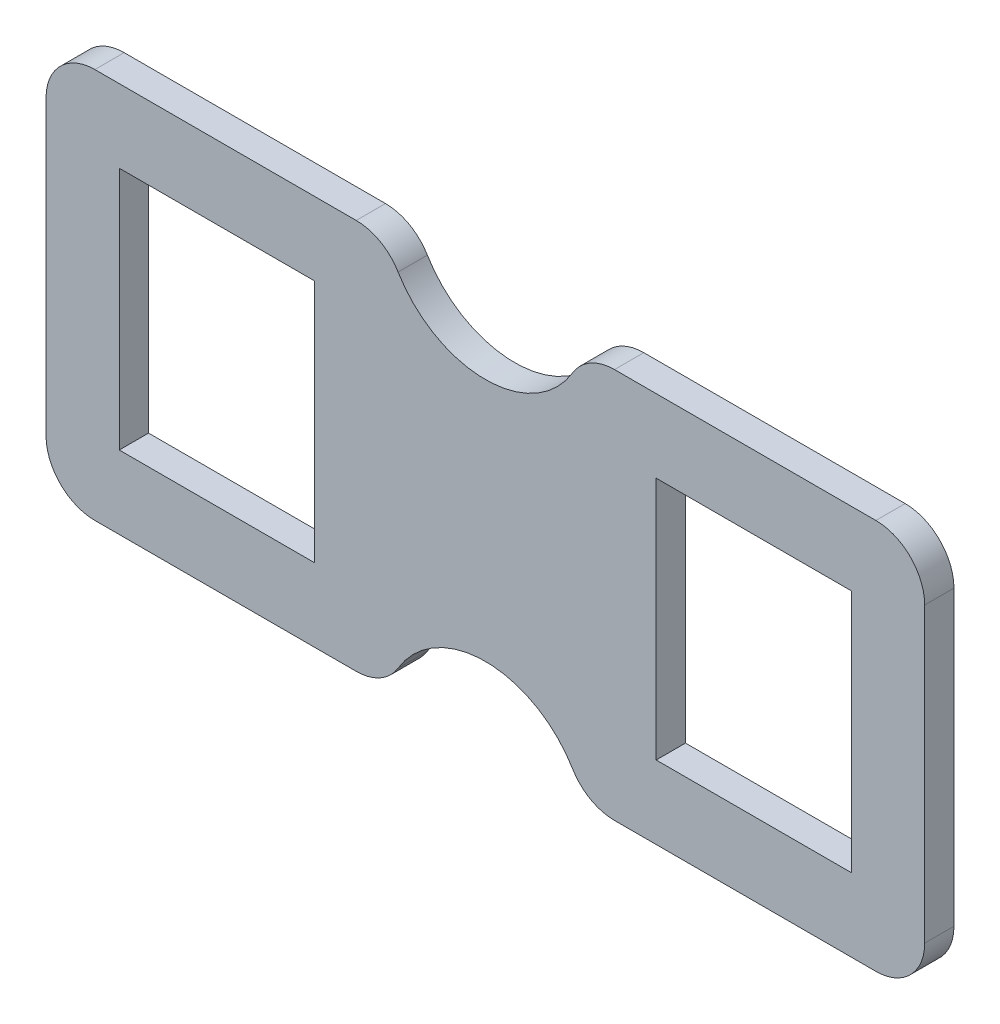
ISO-10303-21;
HEADER;
FILE_DESCRIPTION(('STEP AP214'),'2;1');
FILE_NAME('part.step','',(''),(''),'','','');
FILE_SCHEMA(('AUTOMOTIVE_DESIGN { 1 0 10303 214 1 1 1 1 }'));
ENDSEC;
DATA;
#1=APPLICATION_CONTEXT('core data for automotive mechanical design processes');
#2=APPLICATION_PROTOCOL_DEFINITION('international standard','automotive_design',2000,#1);
#3=PRODUCT_CONTEXT('',#1,'mechanical');
#4=PRODUCT('Part','Part','',(#3));
#5=PRODUCT_RELATED_PRODUCT_CATEGORY('part','',(#4));
#6=PRODUCT_DEFINITION_FORMATION('','',#4);
#7=PRODUCT_DEFINITION_CONTEXT('part definition',#1,'design');
#8=PRODUCT_DEFINITION('design','',#6,#7);
#9=PRODUCT_DEFINITION_SHAPE('','',#8);
#10=(LENGTH_UNIT() NAMED_UNIT(*) SI_UNIT(.MILLI.,.METRE.));
#11=(NAMED_UNIT(*) PLANE_ANGLE_UNIT() SI_UNIT($,.RADIAN.));
#12=(NAMED_UNIT(*) SI_UNIT($,.STERADIAN.) SOLID_ANGLE_UNIT());
#13=UNCERTAINTY_MEASURE_WITH_UNIT(LENGTH_MEASURE(1.E-05),#10,'distance_accuracy_value','');
#14=(GEOMETRIC_REPRESENTATION_CONTEXT(3) GLOBAL_UNCERTAINTY_ASSIGNED_CONTEXT((#13)) GLOBAL_UNIT_ASSIGNED_CONTEXT((#10,
#11,#12)) REPRESENTATION_CONTEXT('',''));
#15=CARTESIAN_POINT('',(0.,0.,0.));
#16=DIRECTION('',(0.,0.,1.));
#17=DIRECTION('',(1.,0.,0.));
#18=AXIS2_PLACEMENT_3D('',#15,#16,#17);
#19=CARTESIAN_POINT('',(-114.3,109.008333333333,7.62));
#20=DIRECTION('',(0.,0.,1.));
#21=DIRECTION('',(1.,0.,0.));
#22=AXIS2_PLACEMENT_3D('',#19,#20,#21);
#23=PLANE('',#22);
#24=DIRECTION('',(-1.,0.,0.));
#25=VECTOR('',#24,1.);
#26=CARTESIAN_POINT('',(-139.7,101.6,7.62));
#27=LINE('',#26,#25);
#28=CARTESIAN_POINT('',(-147.90104165052,101.6,7.62));
#29=VERTEX_POINT('',#28);
#30=CARTESIAN_POINT('',(-215.9,101.6,7.62));
#31=VERTEX_POINT('',#30);
#32=EDGE_CURVE('E313',#29,#31,#27,.T.);
#33=ORIENTED_EDGE('',*,*,#32,.T.);
#34=CARTESIAN_POINT('',(-215.9,88.8999999999999,7.62));
#35=DIRECTION('',(0.,0.,1.));
#36=DIRECTION('',(1.,0.,0.));
#37=AXIS2_PLACEMENT_3D('',#34,#35,#36);
#38=CIRCLE('',#37,12.7);
#39=CARTESIAN_POINT('',(-228.6,88.8999999999999,7.62));
#40=VERTEX_POINT('',#39);
#41=EDGE_CURVE('E418',#31,#40,#38,.T.);
#42=ORIENTED_EDGE('',*,*,#41,.T.);
#43=DIRECTION('',(0.,-1.,0.));
#44=VECTOR('',#43,1.);
#45=CARTESIAN_POINT('',(-228.6,0.,7.62));
#46=LINE('',#45,#44);
#47=CARTESIAN_POINT('',(-228.6,12.7,7.62));
#48=VERTEX_POINT('',#47);
#49=EDGE_CURVE('E317',#40,#48,#46,.T.);
#50=ORIENTED_EDGE('',*,*,#49,.T.);
#51=CARTESIAN_POINT('',(-215.9,12.7,7.62));
#52=DIRECTION('',(0.,0.,1.));
#53=DIRECTION('',(1.,0.,0.));
#54=AXIS2_PLACEMENT_3D('',#51,#52,#53);
#55=CIRCLE('',#54,12.7);
#56=CARTESIAN_POINT('',(-215.9,0.,7.62));
#57=VERTEX_POINT('',#56);
#58=EDGE_CURVE('E415',#48,#57,#55,.T.);
#59=ORIENTED_EDGE('',*,*,#58,.T.);
#60=DIRECTION('',(1.,0.,0.));
#61=VECTOR('',#60,1.);
#62=CARTESIAN_POINT('',(-139.7,0.,7.62));
#63=LINE('',#62,#61);
#64=CARTESIAN_POINT('',(-147.90104165052,0.,7.62));
#65=VERTEX_POINT('',#64);
#66=EDGE_CURVE('E321',#57,#65,#63,.T.);
#67=ORIENTED_EDGE('',*,*,#66,.T.);
#68=CARTESIAN_POINT('',(-147.90104165052,12.7,7.62));
#69=DIRECTION('',(0.,0.,1.));
#70=DIRECTION('',(1.,0.,0.));
#71=AXIS2_PLACEMENT_3D('',#68,#69,#70);
#72=CIRCLE('',#71,12.7);
#73=CARTESIAN_POINT('',(-137.003406520622,6.17837837837838,7.62));
#74=VERTEX_POINT('',#73);
#75=EDGE_CURVE('E412',#65,#74,#72,.T.);
#76=ORIENTED_EDGE('',*,*,#75,.T.);
#77=CARTESIAN_POINT('',(-114.3,-7.40833333333334,7.62));
#78=DIRECTION('',(0.,0.,-1.));
#79=DIRECTION('',(-1.,0.,0.));
#80=AXIS2_PLACEMENT_3D('',#77,#78,#79);
#81=CIRCLE('',#80,26.4583333333333);
#82=CARTESIAN_POINT('',(-91.5965934793782,6.17837837837837,7.62));
#83=VERTEX_POINT('',#82);
#84=EDGE_CURVE('E325',#74,#83,#81,.T.);
#85=ORIENTED_EDGE('',*,*,#84,.T.);
#86=CARTESIAN_POINT('',(-80.6989583494797,12.7,7.62));
#87=DIRECTION('',(0.,0.,1.));
#88=DIRECTION('',(1.,0.,0.));
#89=AXIS2_PLACEMENT_3D('',#86,#87,#88);
#90=CIRCLE('',#89,12.7);
#91=CARTESIAN_POINT('',(-80.6989583494797,0.,7.62));
#92=VERTEX_POINT('',#91);
#93=EDGE_CURVE('E62',#83,#92,#90,.T.);
#94=ORIENTED_EDGE('',*,*,#93,.T.);
#95=DIRECTION('',(1.,0.,0.));
#96=VECTOR('',#95,1.);
#97=CARTESIAN_POINT('',(0.,0.,7.62));
#98=LINE('',#97,#96);
#99=CARTESIAN_POINT('',(-12.7,0.,7.62));
#100=VERTEX_POINT('',#99);
#101=EDGE_CURVE('E328',#92,#100,#98,.T.);
#102=ORIENTED_EDGE('',*,*,#101,.T.);
#103=CARTESIAN_POINT('',(-12.7,12.7,7.62));
#104=DIRECTION('',(0.,0.,1.));
#105=DIRECTION('',(1.,0.,0.));
#106=AXIS2_PLACEMENT_3D('',#103,#104,#105);
#107=CIRCLE('',#106,12.7);
#108=CARTESIAN_POINT('',(0.,12.7,7.62));
#109=VERTEX_POINT('',#108);
#110=EDGE_CURVE('E407',#100,#109,#107,.T.);
#111=ORIENTED_EDGE('',*,*,#110,.T.);
#112=DIRECTION('',(0.,1.,0.));
#113=VECTOR('',#112,1.);
#114=CARTESIAN_POINT('',(0.,0.,7.62));
#115=LINE('',#114,#113);
#116=CARTESIAN_POINT('',(0.,88.9,7.62));
#117=VERTEX_POINT('',#116);
#118=EDGE_CURVE('E300',#109,#117,#115,.T.);
#119=ORIENTED_EDGE('',*,*,#118,.T.);
#120=CARTESIAN_POINT('',(-12.7,88.9,7.62));
#121=DIRECTION('',(0.,0.,1.));
#122=DIRECTION('',(1.,0.,0.));
#123=AXIS2_PLACEMENT_3D('',#120,#121,#122);
#124=CIRCLE('',#123,12.7);
#125=CARTESIAN_POINT('',(-12.7,101.6,7.62));
#126=VERTEX_POINT('',#125);
#127=EDGE_CURVE('E404',#117,#126,#124,.T.);
#128=ORIENTED_EDGE('',*,*,#127,.T.);
#129=DIRECTION('',(-1.,0.,0.));
#130=VECTOR('',#129,1.);
#131=CARTESIAN_POINT('',(0.,101.6,7.62));
#132=LINE('',#131,#130);
#133=CARTESIAN_POINT('',(-80.6989583494797,101.6,7.62));
#134=VERTEX_POINT('',#133);
#135=EDGE_CURVE('E304',#126,#134,#132,.T.);
#136=ORIENTED_EDGE('',*,*,#135,.T.);
#137=CARTESIAN_POINT('',(-80.6989583494797,88.9,7.62));
#138=DIRECTION('',(0.,0.,1.));
#139=DIRECTION('',(1.,0.,0.));
#140=AXIS2_PLACEMENT_3D('',#137,#138,#139);
#141=CIRCLE('',#140,12.7);
#142=CARTESIAN_POINT('',(-91.5965934793782,95.4216216216216,7.62));
#143=VERTEX_POINT('',#142);
#144=EDGE_CURVE('E401',#134,#143,#141,.T.);
#145=ORIENTED_EDGE('',*,*,#144,.T.);
#146=CARTESIAN_POINT('',(-114.3,109.008333333333,7.62));
#147=DIRECTION('',(0.,0.,-1.));
#148=DIRECTION('',(1.,0.,0.));
#149=AXIS2_PLACEMENT_3D('',#146,#147,#148);
#150=CIRCLE('',#149,26.4583333333333);
#151=CARTESIAN_POINT('',(-137.003406520622,95.4216216216216,7.62));
#152=VERTEX_POINT('',#151);
#153=EDGE_CURVE('E309',#143,#152,#150,.T.);
#154=ORIENTED_EDGE('',*,*,#153,.T.);
#155=CARTESIAN_POINT('',(-147.90104165052,88.8999999999999,7.62));
#156=DIRECTION('',(0.,0.,1.));
#157=DIRECTION('',(1.,0.,0.));
#158=AXIS2_PLACEMENT_3D('',#155,#156,#157);
#159=CIRCLE('',#158,12.7);
#160=EDGE_CURVE('E398',#152,#29,#159,.T.);
#161=ORIENTED_EDGE('',*,*,#160,.T.);
#162=EDGE_LOOP('',(#33,#42,#50,#59,#67,#76,#85,#94,#102,#111,#119,#128,#136,#145,#154,#161));
#163=FACE_BOUND('',#162,.T.);
#164=DIRECTION('',(1.,0.,0.));
#165=VECTOR('',#164,1.);
#166=CARTESIAN_POINT('',(-209.55,19.05,7.62));
#167=LINE('',#166,#165);
#168=CARTESIAN_POINT('',(-209.55,19.05,7.62));
#169=VERTEX_POINT('',#168);
#170=CARTESIAN_POINT('',(-158.75,19.05,7.62));
#171=VERTEX_POINT('',#170);
#172=EDGE_CURVE('E260',#169,#171,#167,.T.);
#173=ORIENTED_EDGE('',*,*,#172,.F.);
#174=DIRECTION('',(0.,-1.,0.));
#175=VECTOR('',#174,1.);
#176=CARTESIAN_POINT('',(-209.55,82.5499999999999,7.62));
#177=LINE('',#176,#175);
#178=CARTESIAN_POINT('',(-209.55,82.5499999999999,7.62));
#179=VERTEX_POINT('',#178);
#180=EDGE_CURVE('E257',#179,#169,#177,.T.);
#181=ORIENTED_EDGE('',*,*,#180,.F.);
#182=DIRECTION('',(-1.,0.,0.));
#183=VECTOR('',#182,1.);
#184=CARTESIAN_POINT('',(-209.55,82.5499999999999,7.62));
#185=LINE('',#184,#183);
#186=CARTESIAN_POINT('',(-158.75,82.5499999999999,7.62));
#187=VERTEX_POINT('',#186);
#188=EDGE_CURVE('E268',#187,#179,#185,.T.);
#189=ORIENTED_EDGE('',*,*,#188,.F.);
#190=DIRECTION('',(0.,1.,0.));
#191=VECTOR('',#190,1.);
#192=CARTESIAN_POINT('',(-158.75,82.5499999999999,7.62));
#193=LINE('',#192,#191);
#194=EDGE_CURVE('E264',#171,#187,#193,.T.);
#195=ORIENTED_EDGE('',*,*,#194,.F.);
#196=EDGE_LOOP('',(#173,#181,#189,#195));
#197=FACE_BOUND('',#196,.T.);
#198=DIRECTION('',(1.,0.,0.));
#199=VECTOR('',#198,1.);
#200=CARTESIAN_POINT('',(-69.85,19.05,7.62));
#201=LINE('',#200,#199);
#202=CARTESIAN_POINT('',(-69.85,19.05,7.62));
#203=VERTEX_POINT('',#202);
#204=CARTESIAN_POINT('',(-19.05,19.05,7.62));
#205=VERTEX_POINT('',#204);
#206=EDGE_CURVE('E215',#203,#205,#201,.T.);
#207=ORIENTED_EDGE('',*,*,#206,.F.);
#208=DIRECTION('',(0.,-1.,0.));
#209=VECTOR('',#208,1.);
#210=CARTESIAN_POINT('',(-69.85,19.05,7.62));
#211=LINE('',#210,#209);
#212=CARTESIAN_POINT('',(-69.85,82.5499999999999,7.62));
#213=VERTEX_POINT('',#212);
#214=EDGE_CURVE('E204',#213,#203,#211,.T.);
#215=ORIENTED_EDGE('',*,*,#214,.F.);
#216=DIRECTION('',(-1.,0.,0.));
#217=VECTOR('',#216,1.);
#218=CARTESIAN_POINT('',(-69.85,82.5499999999999,7.62));
#219=LINE('',#218,#217);
#220=CARTESIAN_POINT('',(-19.05,82.5499999999999,7.62));
#221=VERTEX_POINT('',#220);
#222=EDGE_CURVE('E233',#221,#213,#219,.T.);
#223=ORIENTED_EDGE('',*,*,#222,.F.);
#224=DIRECTION('',(0.,1.,0.));
#225=VECTOR('',#224,1.);
#226=CARTESIAN_POINT('',(-19.05,19.05,7.62));
#227=LINE('',#226,#225);
#228=EDGE_CURVE('E229',#205,#221,#227,.T.);
#229=ORIENTED_EDGE('',*,*,#228,.F.);
#230=EDGE_LOOP('',(#207,#215,#223,#229));
#231=FACE_BOUND('',#230,.T.);
#232=ADVANCED_FACE('F39',(#163,#197,#231),#23,.T.);
#233=CARTESIAN_POINT('',(-114.3,109.008333333333,0.));
#234=DIRECTION('',(0.,0.,1.));
#235=DIRECTION('',(1.,0.,0.));
#236=AXIS2_PLACEMENT_3D('',#233,#234,#235);
#237=PLANE('',#236);
#238=DIRECTION('',(0.,-1.,0.));
#239=VECTOR('',#238,1.);
#240=CARTESIAN_POINT('',(-209.55,82.5499999999999,0.));
#241=LINE('',#240,#239);
#242=CARTESIAN_POINT('',(-209.55,82.5499999999999,0.));
#243=VERTEX_POINT('',#242);
#244=CARTESIAN_POINT('',(-209.55,19.05,0.));
#245=VERTEX_POINT('',#244);
#246=EDGE_CURVE('E224',#243,#245,#241,.T.);
#247=ORIENTED_EDGE('',*,*,#246,.T.);
#248=DIRECTION('',(1.,0.,0.));
#249=VECTOR('',#248,1.);
#250=CARTESIAN_POINT('',(-209.55,19.05,0.));
#251=LINE('',#250,#249);
#252=CARTESIAN_POINT('',(-158.75,19.05,0.));
#253=VERTEX_POINT('',#252);
#254=EDGE_CURVE('E275',#245,#253,#251,.T.);
#255=ORIENTED_EDGE('',*,*,#254,.T.);
#256=DIRECTION('',(0.,1.,0.));
#257=VECTOR('',#256,1.);
#258=CARTESIAN_POINT('',(-158.75,82.5499999999999,0.));
#259=LINE('',#258,#257);
#260=CARTESIAN_POINT('',(-158.75,82.5499999999999,0.));
#261=VERTEX_POINT('',#260);
#262=EDGE_CURVE('E279',#253,#261,#259,.T.);
#263=ORIENTED_EDGE('',*,*,#262,.T.);
#264=DIRECTION('',(-1.,0.,0.));
#265=VECTOR('',#264,1.);
#266=CARTESIAN_POINT('',(-209.55,82.5499999999999,0.));
#267=LINE('',#266,#265);
#268=EDGE_CURVE('E261',#261,#243,#267,.T.);
#269=ORIENTED_EDGE('',*,*,#268,.T.);
#270=EDGE_LOOP('',(#247,#255,#263,#269));
#271=FACE_BOUND('',#270,.T.);
#272=DIRECTION('',(0.,-1.,0.));
#273=VECTOR('',#272,1.);
#274=CARTESIAN_POINT('',(-228.6,0.,0.));
#275=LINE('',#274,#273);
#276=CARTESIAN_POINT('',(-228.6,88.8999999999999,0.));
#277=VERTEX_POINT('',#276);
#278=CARTESIAN_POINT('',(-228.6,12.7,0.));
#279=VERTEX_POINT('',#278);
#280=EDGE_CURVE('E347',#277,#279,#275,.T.);
#281=ORIENTED_EDGE('',*,*,#280,.F.);
#282=CARTESIAN_POINT('',(-215.9,88.8999999999999,0.));
#283=DIRECTION('',(0.,0.,1.));
#284=DIRECTION('',(1.,0.,0.));
#285=AXIS2_PLACEMENT_3D('',#282,#283,#284);
#286=CIRCLE('',#285,12.7);
#287=CARTESIAN_POINT('',(-215.9,101.6,0.));
#288=VERTEX_POINT('',#287);
#289=EDGE_CURVE('E388',#277,#288,#286,.F.);
#290=ORIENTED_EDGE('',*,*,#289,.T.);
#291=DIRECTION('',(-1.,0.,0.));
#292=VECTOR('',#291,1.);
#293=CARTESIAN_POINT('',(-139.7,101.6,0.));
#294=LINE('',#293,#292);
#295=CARTESIAN_POINT('',(-147.90104165052,101.6,0.));
#296=VERTEX_POINT('',#295);
#297=EDGE_CURVE('E343',#296,#288,#294,.T.);
#298=ORIENTED_EDGE('',*,*,#297,.F.);
#299=CARTESIAN_POINT('',(-147.90104165052,88.8999999999999,0.));
#300=DIRECTION('',(0.,0.,1.));
#301=DIRECTION('',(1.,0.,0.));
#302=AXIS2_PLACEMENT_3D('',#299,#300,#301);
#303=CIRCLE('',#302,12.7);
#304=CARTESIAN_POINT('',(-137.003406520622,95.4216216216216,0.));
#305=VERTEX_POINT('',#304);
#306=EDGE_CURVE('E367',#296,#305,#303,.F.);
#307=ORIENTED_EDGE('',*,*,#306,.T.);
#308=CARTESIAN_POINT('',(-114.3,109.008333333333,0.));
#309=DIRECTION('',(0.,0.,-1.));
#310=DIRECTION('',(1.,0.,0.));
#311=AXIS2_PLACEMENT_3D('',#308,#309,#310);
#312=CIRCLE('',#311,26.4583333333333);
#313=CARTESIAN_POINT('',(-91.5965934793782,95.4216216216216,0.));
#314=VERTEX_POINT('',#313);
#315=EDGE_CURVE('E339',#314,#305,#312,.T.);
#316=ORIENTED_EDGE('',*,*,#315,.F.);
#317=CARTESIAN_POINT('',(-80.6989583494797,88.9,0.));
#318=DIRECTION('',(0.,0.,1.));
#319=DIRECTION('',(1.,0.,0.));
#320=AXIS2_PLACEMENT_3D('',#317,#318,#319);
#321=CIRCLE('',#320,12.7);
#322=CARTESIAN_POINT('',(-80.6989583494797,101.6,0.));
#323=VERTEX_POINT('',#322);
#324=EDGE_CURVE('E370',#314,#323,#321,.F.);
#325=ORIENTED_EDGE('',*,*,#324,.T.);
#326=DIRECTION('',(-1.,0.,0.));
#327=VECTOR('',#326,1.);
#328=CARTESIAN_POINT('',(0.,101.6,0.));
#329=LINE('',#328,#327);
#330=CARTESIAN_POINT('',(-12.7,101.6,0.));
#331=VERTEX_POINT('',#330);
#332=EDGE_CURVE('E335',#331,#323,#329,.T.);
#333=ORIENTED_EDGE('',*,*,#332,.F.);
#334=CARTESIAN_POINT('',(-12.7,88.9,0.));
#335=DIRECTION('',(0.,0.,1.));
#336=DIRECTION('',(1.,0.,0.));
#337=AXIS2_PLACEMENT_3D('',#334,#335,#336);
#338=CIRCLE('',#337,12.7);
#339=CARTESIAN_POINT('',(0.,88.9,0.));
#340=VERTEX_POINT('',#339);
#341=EDGE_CURVE('E373',#331,#340,#338,.F.);
#342=ORIENTED_EDGE('',*,*,#341,.T.);
#343=DIRECTION('',(0.,1.,0.));
#344=VECTOR('',#343,1.);
#345=CARTESIAN_POINT('',(0.,0.,0.));
#346=LINE('',#345,#344);
#347=CARTESIAN_POINT('',(0.,12.7,0.));
#348=VERTEX_POINT('',#347);
#349=EDGE_CURVE('E299',#348,#340,#346,.T.);
#350=ORIENTED_EDGE('',*,*,#349,.F.);
#351=CARTESIAN_POINT('',(-12.7,12.7,0.));
#352=DIRECTION('',(0.,0.,1.));
#353=DIRECTION('',(1.,0.,0.));
#354=AXIS2_PLACEMENT_3D('',#351,#352,#353);
#355=CIRCLE('',#354,12.7);
#356=CARTESIAN_POINT('',(-12.7,0.,0.));
#357=VERTEX_POINT('',#356);
#358=EDGE_CURVE('E376',#348,#357,#355,.F.);
#359=ORIENTED_EDGE('',*,*,#358,.T.);
#360=DIRECTION('',(1.,0.,0.));
#361=VECTOR('',#360,1.);
#362=CARTESIAN_POINT('',(0.,0.,0.));
#363=LINE('',#362,#361);
#364=CARTESIAN_POINT('',(-80.6989583494797,0.,0.));
#365=VERTEX_POINT('',#364);
#366=EDGE_CURVE('E305',#365,#357,#363,.T.);
#367=ORIENTED_EDGE('',*,*,#366,.F.);
#368=CARTESIAN_POINT('',(-80.6989583494797,12.7,0.));
#369=DIRECTION('',(0.,0.,1.));
#370=DIRECTION('',(1.,0.,0.));
#371=AXIS2_PLACEMENT_3D('',#368,#369,#370);
#372=CIRCLE('',#371,12.7);
#373=CARTESIAN_POINT('',(-91.5965934793782,6.17837837837837,0.));
#374=VERTEX_POINT('',#373);
#375=EDGE_CURVE('E379',#365,#374,#372,.F.);
#376=ORIENTED_EDGE('',*,*,#375,.T.);
#377=CARTESIAN_POINT('',(-114.3,-7.40833333333334,0.));
#378=DIRECTION('',(0.,0.,-1.));
#379=DIRECTION('',(-1.,0.,0.));
#380=AXIS2_PLACEMENT_3D('',#377,#378,#379);
#381=CIRCLE('',#380,26.4583333333333);
#382=CARTESIAN_POINT('',(-137.003406520622,6.17837837837838,0.));
#383=VERTEX_POINT('',#382);
#384=EDGE_CURVE('E355',#383,#374,#381,.T.);
#385=ORIENTED_EDGE('',*,*,#384,.F.);
#386=CARTESIAN_POINT('',(-147.90104165052,12.7,0.));
#387=DIRECTION('',(0.,0.,1.));
#388=DIRECTION('',(1.,0.,0.));
#389=AXIS2_PLACEMENT_3D('',#386,#387,#388);
#390=CIRCLE('',#389,12.7);
#391=CARTESIAN_POINT('',(-147.90104165052,0.,0.));
#392=VERTEX_POINT('',#391);
#393=EDGE_CURVE('E382',#383,#392,#390,.F.);
#394=ORIENTED_EDGE('',*,*,#393,.T.);
#395=DIRECTION('',(1.,0.,0.));
#396=VECTOR('',#395,1.);
#397=CARTESIAN_POINT('',(-139.7,0.,0.));
#398=LINE('',#397,#396);
#399=CARTESIAN_POINT('',(-215.9,0.,0.));
#400=VERTEX_POINT('',#399);
#401=EDGE_CURVE('E351',#400,#392,#398,.T.);
#402=ORIENTED_EDGE('',*,*,#401,.F.);
#403=CARTESIAN_POINT('',(-215.9,12.7,0.));
#404=DIRECTION('',(0.,0.,1.));
#405=DIRECTION('',(1.,0.,0.));
#406=AXIS2_PLACEMENT_3D('',#403,#404,#405);
#407=CIRCLE('',#406,12.7);
#408=EDGE_CURVE('E385',#400,#279,#407,.F.);
#409=ORIENTED_EDGE('',*,*,#408,.T.);
#410=EDGE_LOOP('',(#281,#290,#298,#307,#316,#325,#333,#342,#350,#359,#367,#376,#385,#394,#402,#409));
#411=FACE_BOUND('',#410,.T.);
#412=DIRECTION('',(0.,-1.,0.));
#413=VECTOR('',#412,1.);
#414=CARTESIAN_POINT('',(-69.85,19.05,0.));
#415=LINE('',#414,#413);
#416=CARTESIAN_POINT('',(-69.85,82.5499999999999,0.));
#417=VERTEX_POINT('',#416);
#418=CARTESIAN_POINT('',(-69.85,19.05,0.));
#419=VERTEX_POINT('',#418);
#420=EDGE_CURVE('E238',#417,#419,#415,.T.);
#421=ORIENTED_EDGE('',*,*,#420,.T.);
#422=DIRECTION('',(1.,0.,0.));
#423=VECTOR('',#422,1.);
#424=CARTESIAN_POINT('',(-69.85,19.05,0.));
#425=LINE('',#424,#423);
#426=CARTESIAN_POINT('',(-19.05,19.05,0.));
#427=VERTEX_POINT('',#426);
#428=EDGE_CURVE('E222',#419,#427,#425,.T.);
#429=ORIENTED_EDGE('',*,*,#428,.T.);
#430=DIRECTION('',(0.,1.,0.));
#431=VECTOR('',#430,1.);
#432=CARTESIAN_POINT('',(-19.05,19.05,0.));
#433=LINE('',#432,#431);
#434=CARTESIAN_POINT('',(-19.05,82.5499999999999,0.));
#435=VERTEX_POINT('',#434);
#436=EDGE_CURVE('E243',#427,#435,#433,.T.);
#437=ORIENTED_EDGE('',*,*,#436,.T.);
#438=DIRECTION('',(-1.,0.,0.));
#439=VECTOR('',#438,1.);
#440=CARTESIAN_POINT('',(-69.85,82.5499999999999,0.));
#441=LINE('',#440,#439);
#442=EDGE_CURVE('E216',#435,#417,#441,.T.);
#443=ORIENTED_EDGE('',*,*,#442,.T.);
#444=EDGE_LOOP('',(#421,#429,#437,#443));
#445=FACE_BOUND('',#444,.T.);
#446=ADVANCED_FACE('F473',(#271,#411,#445),#237,.F.);
#447=CARTESIAN_POINT('',(0.,0.,7.62));
#448=DIRECTION('',(-1.,0.,0.));
#449=DIRECTION('',(0.,0.,1.));
#450=AXIS2_PLACEMENT_3D('',#447,#448,#449);
#451=PLANE('',#450);
#452=ORIENTED_EDGE('',*,*,#118,.F.);
#453=DIRECTION('',(0.,0.,-1.));
#454=VECTOR('',#453,1.);
#455=CARTESIAN_POINT('',(0.,12.7,7.62));
#456=LINE('',#455,#454);
#457=EDGE_CURVE('E444',#109,#348,#456,.T.);
#458=ORIENTED_EDGE('',*,*,#457,.T.);
#459=ORIENTED_EDGE('',*,*,#349,.T.);
#460=DIRECTION('',(0.,0.,-1.));
#461=VECTOR('',#460,1.);
#462=CARTESIAN_POINT('',(0.,88.9,7.62));
#463=LINE('',#462,#461);
#464=EDGE_CURVE('E441',#340,#117,#463,.F.);
#465=ORIENTED_EDGE('',*,*,#464,.T.);
#466=EDGE_LOOP('',(#452,#458,#459,#465));
#467=FACE_BOUND('',#466,.T.);
#468=ADVANCED_FACE('F513',(#467),#451,.F.);
#469=CARTESIAN_POINT('',(0.,101.6,7.62));
#470=DIRECTION('',(0.,-1.,0.));
#471=DIRECTION('',(1.,0.,0.));
#472=AXIS2_PLACEMENT_3D('',#469,#470,#471);
#473=PLANE('',#472);
#474=ORIENTED_EDGE('',*,*,#135,.F.);
#475=DIRECTION('',(0.,0.,-1.));
#476=VECTOR('',#475,1.);
#477=CARTESIAN_POINT('',(-12.7,101.6,7.62));
#478=LINE('',#477,#476);
#479=EDGE_CURVE('E451',#126,#331,#478,.T.);
#480=ORIENTED_EDGE('',*,*,#479,.T.);
#481=ORIENTED_EDGE('',*,*,#332,.T.);
#482=DIRECTION('',(0.,0.,-1.));
#483=VECTOR('',#482,1.);
#484=CARTESIAN_POINT('',(-80.6989583494797,101.6,7.62));
#485=LINE('',#484,#483);
#486=EDGE_CURVE('E448',#323,#134,#485,.F.);
#487=ORIENTED_EDGE('',*,*,#486,.T.);
#488=EDGE_LOOP('',(#474,#480,#481,#487));
#489=FACE_BOUND('',#488,.T.);
#490=ADVANCED_FACE('F522',(#489),#473,.F.);
#491=CARTESIAN_POINT('',(-114.3,109.008333333333,7.62));
#492=DIRECTION('',(0.,0.,-1.));
#493=DIRECTION('',(-1.,0.,0.));
#494=AXIS2_PLACEMENT_3D('',#491,#492,#493);
#495=CYLINDRICAL_SURFACE('',#494,26.4583333333333);
#496=ORIENTED_EDGE('',*,*,#153,.F.);
#497=DIRECTION('',(0.,0.,-1.));
#498=VECTOR('',#497,1.);
#499=CARTESIAN_POINT('',(-91.5965934793782,95.4216216216216,7.62));
#500=LINE('',#499,#498);
#501=EDGE_CURVE('E11',#143,#314,#500,.T.);
#502=ORIENTED_EDGE('',*,*,#501,.T.);
#503=ORIENTED_EDGE('',*,*,#315,.T.);
#504=DIRECTION('',(0.,0.,-1.));
#505=VECTOR('',#504,1.);
#506=CARTESIAN_POINT('',(-137.003406520622,95.4216216216216,7.62));
#507=LINE('',#506,#505);
#508=EDGE_CURVE('E48',#305,#152,#507,.F.);
#509=ORIENTED_EDGE('',*,*,#508,.T.);
#510=EDGE_LOOP('',(#496,#502,#503,#509));
#511=FACE_BOUND('',#510,.T.);
#512=ADVANCED_FACE('F458',(#511),#495,.F.);
#513=CARTESIAN_POINT('',(-139.7,101.6,7.62));
#514=DIRECTION('',(0.,-1.,0.));
#515=DIRECTION('',(0.,0.,-1.));
#516=AXIS2_PLACEMENT_3D('',#513,#514,#515);
#517=PLANE('',#516);
#518=ORIENTED_EDGE('',*,*,#297,.T.);
#519=DIRECTION('',(0.,0.,-1.));
#520=VECTOR('',#519,1.);
#521=CARTESIAN_POINT('',(-215.9,101.6,7.62));
#522=LINE('',#521,#520);
#523=EDGE_CURVE('E395',#288,#31,#522,.F.);
#524=ORIENTED_EDGE('',*,*,#523,.T.);
#525=ORIENTED_EDGE('',*,*,#32,.F.);
#526=DIRECTION('',(0.,0.,-1.));
#527=VECTOR('',#526,1.);
#528=CARTESIAN_POINT('',(-147.90104165052,101.6,7.62));
#529=LINE('',#528,#527);
#530=EDGE_CURVE('E391',#29,#296,#529,.T.);
#531=ORIENTED_EDGE('',*,*,#530,.T.);
#532=EDGE_LOOP('',(#518,#524,#525,#531));
#533=FACE_BOUND('',#532,.T.);
#534=ADVANCED_FACE('F469',(#533),#517,.F.);
#535=CARTESIAN_POINT('',(-228.6,0.,7.62));
#536=DIRECTION('',(1.,0.,0.));
#537=DIRECTION('',(0.,1.,0.));
#538=AXIS2_PLACEMENT_3D('',#535,#536,#537);
#539=PLANE('',#538);
#540=ORIENTED_EDGE('',*,*,#49,.F.);
#541=DIRECTION('',(0.,0.,-1.));
#542=VECTOR('',#541,1.);
#543=CARTESIAN_POINT('',(-228.6,88.8999999999999,7.62));
#544=LINE('',#543,#542);
#545=EDGE_CURVE('E363',#40,#277,#544,.T.);
#546=ORIENTED_EDGE('',*,*,#545,.T.);
#547=ORIENTED_EDGE('',*,*,#280,.T.);
#548=DIRECTION('',(0.,0.,-1.));
#549=VECTOR('',#548,1.);
#550=CARTESIAN_POINT('',(-228.6,12.7,7.62));
#551=LINE('',#550,#549);
#552=EDGE_CURVE('E331',#279,#48,#551,.F.);
#553=ORIENTED_EDGE('',*,*,#552,.T.);
#554=EDGE_LOOP('',(#540,#546,#547,#553));
#555=FACE_BOUND('',#554,.T.);
#556=ADVANCED_FACE('F481',(#555),#539,.F.);
#557=CARTESIAN_POINT('',(-139.7,0.,7.62));
#558=DIRECTION('',(0.,1.,0.));
#559=DIRECTION('',(-1.,0.,0.));
#560=AXIS2_PLACEMENT_3D('',#557,#558,#559);
#561=PLANE('',#560);
#562=ORIENTED_EDGE('',*,*,#66,.F.);
#563=DIRECTION('',(0.,0.,-1.));
#564=VECTOR('',#563,1.);
#565=CARTESIAN_POINT('',(-215.9,0.,7.62));
#566=LINE('',#565,#564);
#567=EDGE_CURVE('E424',#57,#400,#566,.T.);
#568=ORIENTED_EDGE('',*,*,#567,.T.);
#569=ORIENTED_EDGE('',*,*,#401,.T.);
#570=DIRECTION('',(0.,0.,-1.));
#571=VECTOR('',#570,1.);
#572=CARTESIAN_POINT('',(-147.90104165052,0.,7.62));
#573=LINE('',#572,#571);
#574=EDGE_CURVE('E421',#392,#65,#573,.F.);
#575=ORIENTED_EDGE('',*,*,#574,.T.);
#576=EDGE_LOOP('',(#562,#568,#569,#575));
#577=FACE_BOUND('',#576,.T.);
#578=ADVANCED_FACE('F490',(#577),#561,.F.);
#579=CARTESIAN_POINT('',(-114.3,-7.40833333333334,7.62));
#580=DIRECTION('',(0.,0.,-1.));
#581=DIRECTION('',(-1.,0.,0.));
#582=AXIS2_PLACEMENT_3D('',#579,#580,#581);
#583=CYLINDRICAL_SURFACE('',#582,26.4583333333333);
#584=ORIENTED_EDGE('',*,*,#84,.F.);
#585=DIRECTION('',(0.,0.,-1.));
#586=VECTOR('',#585,1.);
#587=CARTESIAN_POINT('',(-137.003406520622,6.17837837837837,7.62));
#588=LINE('',#587,#586);
#589=EDGE_CURVE('E431',#74,#383,#588,.T.);
#590=ORIENTED_EDGE('',*,*,#589,.T.);
#591=ORIENTED_EDGE('',*,*,#384,.T.);
#592=DIRECTION('',(0.,0.,-1.));
#593=VECTOR('',#592,1.);
#594=CARTESIAN_POINT('',(-91.5965934793782,6.17837837837836,7.62));
#595=LINE('',#594,#593);
#596=EDGE_CURVE('E428',#374,#83,#595,.F.);
#597=ORIENTED_EDGE('',*,*,#596,.T.);
#598=EDGE_LOOP('',(#584,#590,#591,#597));
#599=FACE_BOUND('',#598,.T.);
#600=ADVANCED_FACE('F499',(#599),#583,.F.);
#601=CARTESIAN_POINT('',(0.,0.,7.62));
#602=DIRECTION('',(0.,1.,0.));
#603=DIRECTION('',(-1.,0.,0.));
#604=AXIS2_PLACEMENT_3D('',#601,#602,#603);
#605=PLANE('',#604);
#606=ORIENTED_EDGE('',*,*,#101,.F.);
#607=DIRECTION('',(0.,0.,-1.));
#608=VECTOR('',#607,1.);
#609=CARTESIAN_POINT('',(-80.6989583494797,0.,7.62));
#610=LINE('',#609,#608);
#611=EDGE_CURVE('E437',#92,#365,#610,.T.);
#612=ORIENTED_EDGE('',*,*,#611,.T.);
#613=ORIENTED_EDGE('',*,*,#366,.T.);
#614=DIRECTION('',(0.,0.,-1.));
#615=VECTOR('',#614,1.);
#616=CARTESIAN_POINT('',(-12.7,0.,7.62));
#617=LINE('',#616,#615);
#618=EDGE_CURVE('E55',#357,#100,#617,.F.);
#619=ORIENTED_EDGE('',*,*,#618,.T.);
#620=EDGE_LOOP('',(#606,#612,#613,#619));
#621=FACE_BOUND('',#620,.T.);
#622=ADVANCED_FACE('F505',(#621),#605,.F.);
#623=CARTESIAN_POINT('',(-209.55,82.5499999999999,7.62));
#624=DIRECTION('',(1.,0.,0.));
#625=DIRECTION('',(0.,0.,-1.));
#626=AXIS2_PLACEMENT_3D('',#623,#624,#625);
#627=PLANE('',#626);
#628=ORIENTED_EDGE('',*,*,#246,.F.);
#629=DIRECTION('',(0.,0.,-1.));
#630=VECTOR('',#629,1.);
#631=CARTESIAN_POINT('',(-209.55,82.5499999999999,7.62));
#632=LINE('',#631,#630);
#633=EDGE_CURVE('E271',#179,#243,#632,.T.);
#634=ORIENTED_EDGE('',*,*,#633,.F.);
#635=ORIENTED_EDGE('',*,*,#180,.T.);
#636=DIRECTION('',(0.,0.,-1.));
#637=VECTOR('',#636,1.);
#638=CARTESIAN_POINT('',(-209.55,19.05,7.62));
#639=LINE('',#638,#637);
#640=EDGE_CURVE('E295',#169,#245,#639,.T.);
#641=ORIENTED_EDGE('',*,*,#640,.T.);
#642=EDGE_LOOP('',(#628,#634,#635,#641));
#643=FACE_BOUND('',#642,.T.);
#644=ADVANCED_FACE('F540',(#643),#627,.T.);
#645=CARTESIAN_POINT('',(-209.55,19.05,7.62));
#646=DIRECTION('',(0.,1.,0.));
#647=DIRECTION('',(0.,0.,1.));
#648=AXIS2_PLACEMENT_3D('',#645,#646,#647);
#649=PLANE('',#648);
#650=ORIENTED_EDGE('',*,*,#254,.F.);
#651=ORIENTED_EDGE('',*,*,#640,.F.);
#652=ORIENTED_EDGE('',*,*,#172,.T.);
#653=DIRECTION('',(0.,0.,-1.));
#654=VECTOR('',#653,1.);
#655=CARTESIAN_POINT('',(-158.75,19.05,7.62));
#656=LINE('',#655,#654);
#657=EDGE_CURVE('E292',#171,#253,#656,.T.);
#658=ORIENTED_EDGE('',*,*,#657,.T.);
#659=EDGE_LOOP('',(#650,#651,#652,#658));
#660=FACE_BOUND('',#659,.T.);
#661=ADVANCED_FACE('F660',(#660),#649,.T.);
#662=CARTESIAN_POINT('',(-158.75,82.5499999999999,7.62));
#663=DIRECTION('',(-1.,0.,0.));
#664=DIRECTION('',(0.,0.,1.));
#665=AXIS2_PLACEMENT_3D('',#662,#663,#664);
#666=PLANE('',#665);
#667=ORIENTED_EDGE('',*,*,#262,.F.);
#668=ORIENTED_EDGE('',*,*,#657,.F.);
#669=ORIENTED_EDGE('',*,*,#194,.T.);
#670=DIRECTION('',(0.,0.,-1.));
#671=VECTOR('',#670,1.);
#672=CARTESIAN_POINT('',(-158.75,82.5499999999999,7.62));
#673=LINE('',#672,#671);
#674=EDGE_CURVE('E289',#187,#261,#673,.T.);
#675=ORIENTED_EDGE('',*,*,#674,.T.);
#676=EDGE_LOOP('',(#667,#668,#669,#675));
#677=FACE_BOUND('',#676,.T.);
#678=ADVANCED_FACE('F651',(#677),#666,.T.);
#679=CARTESIAN_POINT('',(-209.55,82.5499999999999,7.62));
#680=DIRECTION('',(0.,-1.,0.));
#681=DIRECTION('',(0.,0.,-1.));
#682=AXIS2_PLACEMENT_3D('',#679,#680,#681);
#683=PLANE('',#682);
#684=ORIENTED_EDGE('',*,*,#268,.F.);
#685=ORIENTED_EDGE('',*,*,#674,.F.);
#686=ORIENTED_EDGE('',*,*,#188,.T.);
#687=ORIENTED_EDGE('',*,*,#633,.T.);
#688=EDGE_LOOP('',(#684,#685,#686,#687));
#689=FACE_BOUND('',#688,.T.);
#690=ADVANCED_FACE('F643',(#689),#683,.T.);
#691=CARTESIAN_POINT('',(-69.85,19.05,7.62));
#692=DIRECTION('',(1.,0.,0.));
#693=DIRECTION('',(0.,0.,-1.));
#694=AXIS2_PLACEMENT_3D('',#691,#692,#693);
#695=PLANE('',#694);
#696=ORIENTED_EDGE('',*,*,#420,.F.);
#697=DIRECTION('',(0.,0.,-1.));
#698=VECTOR('',#697,1.);
#699=CARTESIAN_POINT('',(-69.85,82.5499999999999,7.62));
#700=LINE('',#699,#698);
#701=EDGE_CURVE('E210',#213,#417,#700,.T.);
#702=ORIENTED_EDGE('',*,*,#701,.F.);
#703=ORIENTED_EDGE('',*,*,#214,.T.);
#704=DIRECTION('',(0.,0.,-1.));
#705=VECTOR('',#704,1.);
#706=CARTESIAN_POINT('',(-69.85,19.05,7.62));
#707=LINE('',#706,#705);
#708=EDGE_CURVE('E207',#203,#419,#707,.T.);
#709=ORIENTED_EDGE('',*,*,#708,.T.);
#710=EDGE_LOOP('',(#696,#702,#703,#709));
#711=FACE_BOUND('',#710,.T.);
#712=ADVANCED_FACE('F206',(#711),#695,.T.);
#713=CARTESIAN_POINT('',(-69.85,19.05,7.62));
#714=DIRECTION('',(0.,1.,0.));
#715=DIRECTION('',(0.,0.,1.));
#716=AXIS2_PLACEMENT_3D('',#713,#714,#715);
#717=PLANE('',#716);
#718=ORIENTED_EDGE('',*,*,#428,.F.);
#719=ORIENTED_EDGE('',*,*,#708,.F.);
#720=ORIENTED_EDGE('',*,*,#206,.T.);
#721=DIRECTION('',(0.,0.,-1.));
#722=VECTOR('',#721,1.);
#723=CARTESIAN_POINT('',(-19.05,19.05,7.62));
#724=LINE('',#723,#722);
#725=EDGE_CURVE('E225',#205,#427,#724,.T.);
#726=ORIENTED_EDGE('',*,*,#725,.T.);
#727=EDGE_LOOP('',(#718,#719,#720,#726));
#728=FACE_BOUND('',#727,.T.);
#729=ADVANCED_FACE('F219',(#728),#717,.T.);
#730=CARTESIAN_POINT('',(-19.05,19.05,7.62));
#731=DIRECTION('',(-1.,0.,0.));
#732=DIRECTION('',(0.,0.,1.));
#733=AXIS2_PLACEMENT_3D('',#730,#731,#732);
#734=PLANE('',#733);
#735=ORIENTED_EDGE('',*,*,#436,.F.);
#736=ORIENTED_EDGE('',*,*,#725,.F.);
#737=ORIENTED_EDGE('',*,*,#228,.T.);
#738=DIRECTION('',(0.,0.,-1.));
#739=VECTOR('',#738,1.);
#740=CARTESIAN_POINT('',(-19.05,82.5499999999999,7.62));
#741=LINE('',#740,#739);
#742=EDGE_CURVE('E252',#221,#435,#741,.T.);
#743=ORIENTED_EDGE('',*,*,#742,.T.);
#744=EDGE_LOOP('',(#735,#736,#737,#743));
#745=FACE_BOUND('',#744,.T.);
#746=ADVANCED_FACE('F619',(#745),#734,.T.);
#747=CARTESIAN_POINT('',(-69.85,82.5499999999999,7.62));
#748=DIRECTION('',(0.,-1.,0.));
#749=DIRECTION('',(0.,0.,-1.));
#750=AXIS2_PLACEMENT_3D('',#747,#748,#749);
#751=PLANE('',#750);
#752=ORIENTED_EDGE('',*,*,#442,.F.);
#753=ORIENTED_EDGE('',*,*,#742,.F.);
#754=ORIENTED_EDGE('',*,*,#222,.T.);
#755=ORIENTED_EDGE('',*,*,#701,.T.);
#756=EDGE_LOOP('',(#752,#753,#754,#755));
#757=FACE_BOUND('',#756,.T.);
#758=ADVANCED_FACE('F561',(#757),#751,.T.);
#759=CARTESIAN_POINT('',(-215.9,88.8999999999999,7.62));
#760=DIRECTION('',(0.,0.,-1.));
#761=DIRECTION('',(-1.,0.,0.));
#762=AXIS2_PLACEMENT_3D('',#759,#760,#761);
#763=CYLINDRICAL_SURFACE('',#762,12.7);
#764=ORIENTED_EDGE('',*,*,#41,.F.);
#765=ORIENTED_EDGE('',*,*,#523,.F.);
#766=ORIENTED_EDGE('',*,*,#289,.F.);
#767=ORIENTED_EDGE('',*,*,#545,.F.);
#768=EDGE_LOOP('',(#764,#765,#766,#767));
#769=FACE_BOUND('',#768,.T.);
#770=ADVANCED_FACE('F478',(#769),#763,.T.);
#771=CARTESIAN_POINT('',(-215.9,12.7,7.62));
#772=DIRECTION('',(0.,0.,-1.));
#773=DIRECTION('',(-1.,0.,0.));
#774=AXIS2_PLACEMENT_3D('',#771,#772,#773);
#775=CYLINDRICAL_SURFACE('',#774,12.7);
#776=ORIENTED_EDGE('',*,*,#58,.F.);
#777=ORIENTED_EDGE('',*,*,#552,.F.);
#778=ORIENTED_EDGE('',*,*,#408,.F.);
#779=ORIENTED_EDGE('',*,*,#567,.F.);
#780=EDGE_LOOP('',(#776,#777,#778,#779));
#781=FACE_BOUND('',#780,.T.);
#782=ADVANCED_FACE('F487',(#781),#775,.T.);
#783=CARTESIAN_POINT('',(-147.90104165052,12.7,7.62));
#784=DIRECTION('',(0.,0.,-1.));
#785=DIRECTION('',(-1.,0.,0.));
#786=AXIS2_PLACEMENT_3D('',#783,#784,#785);
#787=CYLINDRICAL_SURFACE('',#786,12.7);
#788=ORIENTED_EDGE('',*,*,#75,.F.);
#789=ORIENTED_EDGE('',*,*,#574,.F.);
#790=ORIENTED_EDGE('',*,*,#393,.F.);
#791=ORIENTED_EDGE('',*,*,#589,.F.);
#792=EDGE_LOOP('',(#788,#789,#790,#791));
#793=FACE_BOUND('',#792,.T.);
#794=ADVANCED_FACE('F496',(#793),#787,.T.);
#795=CARTESIAN_POINT('',(-80.6989583494797,12.7,7.62));
#796=DIRECTION('',(0.,0.,-1.));
#797=DIRECTION('',(-1.,0.,0.));
#798=AXIS2_PLACEMENT_3D('',#795,#796,#797);
#799=CYLINDRICAL_SURFACE('',#798,12.7);
#800=ORIENTED_EDGE('',*,*,#93,.F.);
#801=ORIENTED_EDGE('',*,*,#596,.F.);
#802=ORIENTED_EDGE('',*,*,#375,.F.);
#803=ORIENTED_EDGE('',*,*,#611,.F.);
#804=EDGE_LOOP('',(#800,#801,#802,#803));
#805=FACE_BOUND('',#804,.T.);
#806=ADVANCED_FACE('F503',(#805),#799,.T.);
#807=CARTESIAN_POINT('',(-12.7,12.7,7.62));
#808=DIRECTION('',(0.,0.,-1.));
#809=DIRECTION('',(-1.,0.,0.));
#810=AXIS2_PLACEMENT_3D('',#807,#808,#809);
#811=CYLINDRICAL_SURFACE('',#810,12.7);
#812=ORIENTED_EDGE('',*,*,#110,.F.);
#813=ORIENTED_EDGE('',*,*,#618,.F.);
#814=ORIENTED_EDGE('',*,*,#358,.F.);
#815=ORIENTED_EDGE('',*,*,#457,.F.);
#816=EDGE_LOOP('',(#812,#813,#814,#815));
#817=FACE_BOUND('',#816,.T.);
#818=ADVANCED_FACE('F510',(#817),#811,.T.);
#819=CARTESIAN_POINT('',(-12.7,88.9,7.62));
#820=DIRECTION('',(0.,0.,-1.));
#821=DIRECTION('',(-1.,0.,0.));
#822=AXIS2_PLACEMENT_3D('',#819,#820,#821);
#823=CYLINDRICAL_SURFACE('',#822,12.7);
#824=ORIENTED_EDGE('',*,*,#127,.F.);
#825=ORIENTED_EDGE('',*,*,#464,.F.);
#826=ORIENTED_EDGE('',*,*,#341,.F.);
#827=ORIENTED_EDGE('',*,*,#479,.F.);
#828=EDGE_LOOP('',(#824,#825,#826,#827));
#829=FACE_BOUND('',#828,.T.);
#830=ADVANCED_FACE('F519',(#829),#823,.T.);
#831=CARTESIAN_POINT('',(-80.6989583494797,88.9,7.62));
#832=DIRECTION('',(0.,0.,-1.));
#833=DIRECTION('',(-1.,0.,0.));
#834=AXIS2_PLACEMENT_3D('',#831,#832,#833);
#835=CYLINDRICAL_SURFACE('',#834,12.7);
#836=ORIENTED_EDGE('',*,*,#144,.F.);
#837=ORIENTED_EDGE('',*,*,#486,.F.);
#838=ORIENTED_EDGE('',*,*,#324,.F.);
#839=ORIENTED_EDGE('',*,*,#501,.F.);
#840=EDGE_LOOP('',(#836,#837,#838,#839));
#841=FACE_BOUND('',#840,.T.);
#842=ADVANCED_FACE('F525',(#841),#835,.T.);
#843=CARTESIAN_POINT('',(-147.90104165052,88.8999999999999,7.62));
#844=DIRECTION('',(0.,0.,-1.));
#845=DIRECTION('',(-1.,0.,0.));
#846=AXIS2_PLACEMENT_3D('',#843,#844,#845);
#847=CYLINDRICAL_SURFACE('',#846,12.7);
#848=ORIENTED_EDGE('',*,*,#160,.F.);
#849=ORIENTED_EDGE('',*,*,#508,.F.);
#850=ORIENTED_EDGE('',*,*,#306,.F.);
#851=ORIENTED_EDGE('',*,*,#530,.F.);
#852=EDGE_LOOP('',(#848,#849,#850,#851));
#853=FACE_BOUND('',#852,.T.);
#854=ADVANCED_FACE('F41',(#853),#847,.T.);
#855=CLOSED_SHELL('',(#232,#446,#468,#490,#512,#534,#556,#578,#600,#622,#644,#661,#678,#690,
#712,#729,#746,#758,#770,#782,#794,#806,#818,#830,#842,#854));
#856=MANIFOLD_SOLID_BREP('B2',#855);
#857=ADVANCED_BREP_SHAPE_REPRESENTATION('',(#18,#856),#14);
#858=SHAPE_DEFINITION_REPRESENTATION(#9,#857);
ENDSEC;
END-ISO-10303-21;
